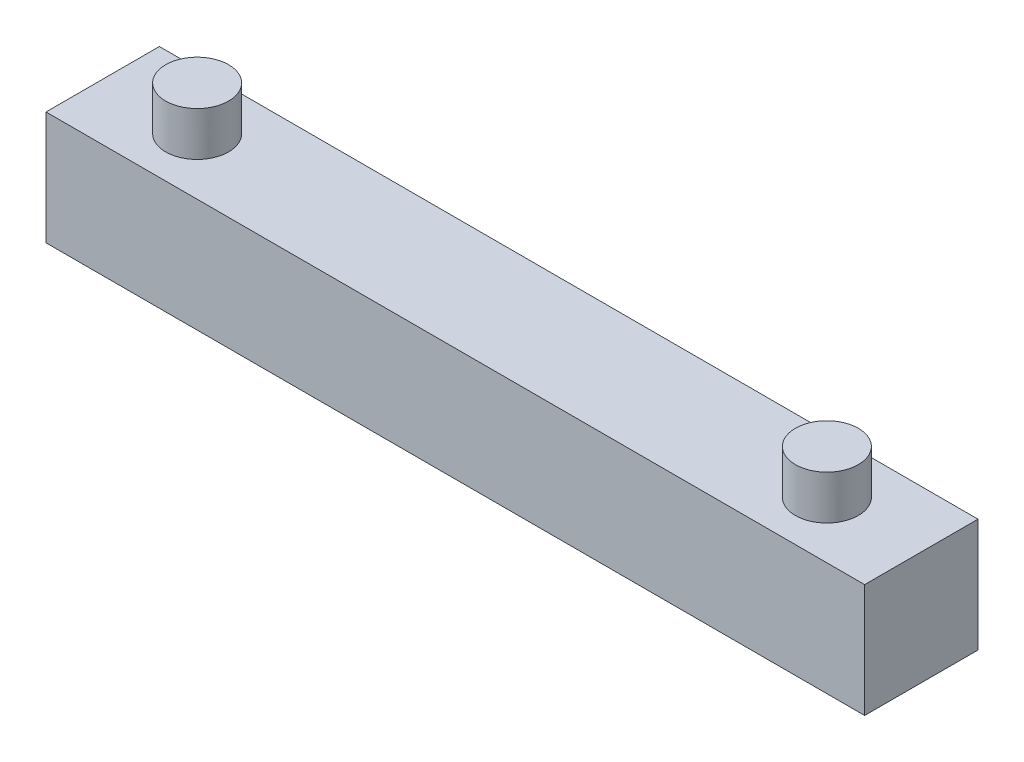
ISO-10303-21;
HEADER;
FILE_DESCRIPTION(('STEP AP214'),'2;1');
FILE_NAME('part.step','',(''),(''),'','','');
FILE_SCHEMA(('AUTOMOTIVE_DESIGN { 1 0 10303 214 1 1 1 1 }'));
ENDSEC;
DATA;
#1=APPLICATION_CONTEXT('core data for automotive mechanical design processes');
#2=APPLICATION_PROTOCOL_DEFINITION('international standard','automotive_design',2000,#1);
#3=PRODUCT_CONTEXT('',#1,'mechanical');
#4=PRODUCT('Part','Part','',(#3));
#5=PRODUCT_RELATED_PRODUCT_CATEGORY('part','',(#4));
#6=PRODUCT_DEFINITION_FORMATION('','',#4);
#7=PRODUCT_DEFINITION_CONTEXT('part definition',#1,'design');
#8=PRODUCT_DEFINITION('design','',#6,#7);
#9=PRODUCT_DEFINITION_SHAPE('','',#8);
#10=(LENGTH_UNIT() NAMED_UNIT(*) SI_UNIT(.MILLI.,.METRE.));
#11=(NAMED_UNIT(*) PLANE_ANGLE_UNIT() SI_UNIT($,.RADIAN.));
#12=(NAMED_UNIT(*) SI_UNIT($,.STERADIAN.) SOLID_ANGLE_UNIT());
#13=UNCERTAINTY_MEASURE_WITH_UNIT(LENGTH_MEASURE(1.E-05),#10,'distance_accuracy_value','');
#14=(GEOMETRIC_REPRESENTATION_CONTEXT(3) GLOBAL_UNCERTAINTY_ASSIGNED_CONTEXT((#13)) GLOBAL_UNIT_ASSIGNED_CONTEXT((#10,
#11,#12)) REPRESENTATION_CONTEXT('',''));
#15=CARTESIAN_POINT('',(0.,0.,0.));
#16=DIRECTION('',(0.,0.,1.));
#17=DIRECTION('',(1.,0.,0.));
#18=AXIS2_PLACEMENT_3D('',#15,#16,#17);
#19=CARTESIAN_POINT('',(0.,9.,0.));
#20=DIRECTION('',(1.,0.,0.));
#21=DIRECTION('',(0.,0.,-1.));
#22=AXIS2_PLACEMENT_3D('',#19,#20,#21);
#23=PLANE('',#22);
#24=DIRECTION('',(0.,0.,1.));
#25=VECTOR('',#24,1.);
#26=CARTESIAN_POINT('',(0.,0.,0.));
#27=LINE('',#26,#25);
#28=CARTESIAN_POINT('',(0.,0.,-9.));
#29=VERTEX_POINT('',#28);
#30=CARTESIAN_POINT('',(0.,0.,0.));
#31=VERTEX_POINT('',#30);
#32=EDGE_CURVE('E100',#29,#31,#27,.T.);
#33=ORIENTED_EDGE('',*,*,#32,.T.);
#34=DIRECTION('',(0.,-1.,0.));
#35=VECTOR('',#34,1.);
#36=CARTESIAN_POINT('',(0.,9.,0.));
#37=LINE('',#36,#35);
#38=CARTESIAN_POINT('',(0.,9.,0.));
#39=VERTEX_POINT('',#38);
#40=EDGE_CURVE('E91',#39,#31,#37,.T.);
#41=ORIENTED_EDGE('',*,*,#40,.F.);
#42=DIRECTION('',(0.,0.,1.));
#43=VECTOR('',#42,1.);
#44=CARTESIAN_POINT('',(0.,9.,0.));
#45=LINE('',#44,#43);
#46=CARTESIAN_POINT('',(0.,9.,-9.));
#47=VERTEX_POINT('',#46);
#48=EDGE_CURVE('E85',#47,#39,#45,.T.);
#49=ORIENTED_EDGE('',*,*,#48,.F.);
#50=DIRECTION('',(0.,-1.,0.));
#51=VECTOR('',#50,1.);
#52=CARTESIAN_POINT('',(0.,9.,-9.));
#53=LINE('',#52,#51);
#54=EDGE_CURVE('E96',#47,#29,#53,.T.);
#55=ORIENTED_EDGE('',*,*,#54,.T.);
#56=EDGE_LOOP('',(#33,#41,#49,#55));
#57=FACE_BOUND('',#56,.T.);
#58=ADVANCED_FACE('F33',(#57),#23,.F.);
#59=CARTESIAN_POINT('',(0.,9.,0.));
#60=DIRECTION('',(0.,0.,-1.));
#61=DIRECTION('',(-1.,0.,0.));
#62=AXIS2_PLACEMENT_3D('',#59,#60,#61);
#63=PLANE('',#62);
#64=DIRECTION('',(1.,0.,0.));
#65=VECTOR('',#64,1.);
#66=CARTESIAN_POINT('',(0.,0.,0.));
#67=LINE('',#66,#65);
#68=CARTESIAN_POINT('',(65.,0.,0.));
#69=VERTEX_POINT('',#68);
#70=EDGE_CURVE('E90',#31,#69,#67,.T.);
#71=ORIENTED_EDGE('',*,*,#70,.T.);
#72=DIRECTION('',(0.,-1.,0.));
#73=VECTOR('',#72,1.);
#74=CARTESIAN_POINT('',(65.,9.,0.));
#75=LINE('',#74,#73);
#76=CARTESIAN_POINT('',(65.,9.,0.));
#77=VERTEX_POINT('',#76);
#78=EDGE_CURVE('E88',#77,#69,#75,.T.);
#79=ORIENTED_EDGE('',*,*,#78,.F.);
#80=DIRECTION('',(1.,0.,0.));
#81=VECTOR('',#80,1.);
#82=CARTESIAN_POINT('',(0.,9.,0.));
#83=LINE('',#82,#81);
#84=EDGE_CURVE('E80',#39,#77,#83,.T.);
#85=ORIENTED_EDGE('',*,*,#84,.F.);
#86=ORIENTED_EDGE('',*,*,#40,.T.);
#87=EDGE_LOOP('',(#71,#79,#85,#86));
#88=FACE_BOUND('',#87,.T.);
#89=ADVANCED_FACE('F89',(#88),#63,.F.);
#90=CARTESIAN_POINT('',(65.,9.,0.));
#91=DIRECTION('',(-1.,0.,0.));
#92=DIRECTION('',(0.,0.,1.));
#93=AXIS2_PLACEMENT_3D('',#90,#91,#92);
#94=PLANE('',#93);
#95=DIRECTION('',(0.,0.,-1.));
#96=VECTOR('',#95,1.);
#97=CARTESIAN_POINT('',(65.,0.,0.));
#98=LINE('',#97,#96);
#99=CARTESIAN_POINT('',(65.,0.,-9.));
#100=VERTEX_POINT('',#99);
#101=EDGE_CURVE('E66',#69,#100,#98,.T.);
#102=ORIENTED_EDGE('',*,*,#101,.T.);
#103=DIRECTION('',(0.,-1.,0.));
#104=VECTOR('',#103,1.);
#105=CARTESIAN_POINT('',(65.,9.,-9.));
#106=LINE('',#105,#104);
#107=CARTESIAN_POINT('',(65.,9.,-9.));
#108=VERTEX_POINT('',#107);
#109=EDGE_CURVE('E92',#108,#100,#106,.T.);
#110=ORIENTED_EDGE('',*,*,#109,.F.);
#111=DIRECTION('',(0.,0.,-1.));
#112=VECTOR('',#111,1.);
#113=CARTESIAN_POINT('',(65.,9.,0.));
#114=LINE('',#113,#112);
#115=EDGE_CURVE('E83',#77,#108,#114,.T.);
#116=ORIENTED_EDGE('',*,*,#115,.F.);
#117=ORIENTED_EDGE('',*,*,#78,.T.);
#118=EDGE_LOOP('',(#102,#110,#116,#117));
#119=FACE_BOUND('',#118,.T.);
#120=ADVANCED_FACE('F94',(#119),#94,.F.);
#121=CARTESIAN_POINT('',(0.,9.,-9.));
#122=DIRECTION('',(0.,0.,1.));
#123=DIRECTION('',(1.,0.,0.));
#124=AXIS2_PLACEMENT_3D('',#121,#122,#123);
#125=PLANE('',#124);
#126=DIRECTION('',(-1.,0.,0.));
#127=VECTOR('',#126,1.);
#128=CARTESIAN_POINT('',(0.,0.,-9.));
#129=LINE('',#128,#127);
#130=EDGE_CURVE('E72',#100,#29,#129,.T.);
#131=ORIENTED_EDGE('',*,*,#130,.T.);
#132=ORIENTED_EDGE('',*,*,#54,.F.);
#133=DIRECTION('',(-1.,0.,0.));
#134=VECTOR('',#133,1.);
#135=CARTESIAN_POINT('',(0.,9.,-9.));
#136=LINE('',#135,#134);
#137=EDGE_CURVE('E49',#108,#47,#136,.T.);
#138=ORIENTED_EDGE('',*,*,#137,.F.);
#139=ORIENTED_EDGE('',*,*,#109,.T.);
#140=EDGE_LOOP('',(#131,#132,#138,#139));
#141=FACE_BOUND('',#140,.T.);
#142=ADVANCED_FACE('F116',(#141),#125,.F.);
#143=CARTESIAN_POINT('',(0.,9.,0.));
#144=DIRECTION('',(0.,-1.,0.));
#145=DIRECTION('',(0.,0.,-1.));
#146=AXIS2_PLACEMENT_3D('',#143,#144,#145);
#147=PLANE('',#146);
#148=CARTESIAN_POINT('',(57.5,9.,-4.5));
#149=DIRECTION('',(0.,-1.,0.));
#150=DIRECTION('',(0.,0.,-1.));
#151=AXIS2_PLACEMENT_3D('',#148,#149,#150);
#152=CIRCLE('',#151,2.5);
#153=CARTESIAN_POINT('',(57.5,9.,-7.));
#154=VERTEX_POINT('',#153);
#155=EDGE_CURVE('E11',#154,#154,#152,.F.);
#156=ORIENTED_EDGE('',*,*,#155,.F.);
#157=EDGE_LOOP('',(#156));
#158=FACE_BOUND('',#157,.T.);
#159=CARTESIAN_POINT('',(7.5,9.,-4.5));
#160=DIRECTION('',(0.,-1.,0.));
#161=DIRECTION('',(0.,0.,-1.));
#162=AXIS2_PLACEMENT_3D('',#159,#160,#161);
#163=CIRCLE('',#162,2.5);
#164=CARTESIAN_POINT('',(7.5,9.,-7.));
#165=VERTEX_POINT('',#164);
#166=EDGE_CURVE('E41',#165,#165,#163,.F.);
#167=ORIENTED_EDGE('',*,*,#166,.F.);
#168=EDGE_LOOP('',(#167));
#169=FACE_BOUND('',#168,.T.);
#170=ORIENTED_EDGE('',*,*,#48,.T.);
#171=ORIENTED_EDGE('',*,*,#84,.T.);
#172=ORIENTED_EDGE('',*,*,#115,.T.);
#173=ORIENTED_EDGE('',*,*,#137,.T.);
#174=EDGE_LOOP('',(#170,#171,#172,#173));
#175=FACE_BOUND('',#174,.T.);
#176=ADVANCED_FACE('F81',(#158,#169,#175),#147,.F.);
#177=CARTESIAN_POINT('',(0.,0.,0.));
#178=DIRECTION('',(0.,-1.,0.));
#179=DIRECTION('',(0.,0.,-1.));
#180=AXIS2_PLACEMENT_3D('',#177,#178,#179);
#181=PLANE('',#180);
#182=ORIENTED_EDGE('',*,*,#32,.F.);
#183=ORIENTED_EDGE('',*,*,#130,.F.);
#184=ORIENTED_EDGE('',*,*,#101,.F.);
#185=ORIENTED_EDGE('',*,*,#70,.F.);
#186=EDGE_LOOP('',(#182,#183,#184,#185));
#187=FACE_BOUND('',#186,.T.);
#188=ADVANCED_FACE('F115',(#187),#181,.T.);
#189=CARTESIAN_POINT('',(7.5,12.5,-4.5));
#190=DIRECTION('',(0.,-1.,0.));
#191=DIRECTION('',(0.,0.,-1.));
#192=AXIS2_PLACEMENT_3D('',#189,#190,#191);
#193=CYLINDRICAL_SURFACE('',#192,2.5);
#194=CARTESIAN_POINT('',(7.5,12.5,-4.5));
#195=DIRECTION('',(0.,1.,0.));
#196=DIRECTION('',(0.,0.,1.));
#197=AXIS2_PLACEMENT_3D('',#194,#195,#196);
#198=CIRCLE('',#197,2.5);
#199=CARTESIAN_POINT('',(7.5,12.5,-2.));
#200=VERTEX_POINT('',#199);
#201=EDGE_CURVE('E103',#200,#200,#198,.T.);
#202=ORIENTED_EDGE('',*,*,#201,.F.);
#203=EDGE_LOOP('',(#202));
#204=FACE_BOUND('',#203,.T.);
#205=ORIENTED_EDGE('',*,*,#166,.T.);
#206=EDGE_LOOP('',(#205));
#207=FACE_BOUND('',#206,.T.);
#208=ADVANCED_FACE('F112',(#204,#207),#193,.T.);
#209=CARTESIAN_POINT('',(7.5,12.5,-4.5));
#210=DIRECTION('',(0.,1.,0.));
#211=DIRECTION('',(0.,0.,1.));
#212=AXIS2_PLACEMENT_3D('',#209,#210,#211);
#213=PLANE('',#212);
#214=ORIENTED_EDGE('',*,*,#201,.T.);
#215=EDGE_LOOP('',(#214));
#216=FACE_BOUND('',#215,.T.);
#217=ADVANCED_FACE('F146',(#216),#213,.T.);
#218=CARTESIAN_POINT('',(57.5,12.5,-4.5));
#219=DIRECTION('',(0.,-1.,0.));
#220=DIRECTION('',(0.,0.,-1.));
#221=AXIS2_PLACEMENT_3D('',#218,#219,#220);
#222=CYLINDRICAL_SURFACE('',#221,2.5);
#223=CARTESIAN_POINT('',(57.5,12.5,-4.5));
#224=DIRECTION('',(0.,1.,0.));
#225=DIRECTION('',(0.,0.,1.));
#226=AXIS2_PLACEMENT_3D('',#223,#224,#225);
#227=CIRCLE('',#226,2.5);
#228=CARTESIAN_POINT('',(57.5,12.5,-2.));
#229=VERTEX_POINT('',#228);
#230=EDGE_CURVE('E137',#229,#229,#227,.T.);
#231=ORIENTED_EDGE('',*,*,#230,.F.);
#232=EDGE_LOOP('',(#231));
#233=FACE_BOUND('',#232,.T.);
#234=ORIENTED_EDGE('',*,*,#155,.T.);
#235=EDGE_LOOP('',(#234));
#236=FACE_BOUND('',#235,.T.);
#237=ADVANCED_FACE('F143',(#233,#236),#222,.T.);
#238=CARTESIAN_POINT('',(57.5,12.5,-4.5));
#239=DIRECTION('',(0.,1.,0.));
#240=DIRECTION('',(0.,0.,1.));
#241=AXIS2_PLACEMENT_3D('',#238,#239,#240);
#242=PLANE('',#241);
#243=ORIENTED_EDGE('',*,*,#230,.T.);
#244=EDGE_LOOP('',(#243));
#245=FACE_BOUND('',#244,.T.);
#246=ADVANCED_FACE('F141',(#245),#242,.T.);
#247=CLOSED_SHELL('',(#58,#89,#120,#142,#176,#188,#208,#217,#237,#246));
#248=MANIFOLD_SOLID_BREP('B2',#247);
#249=ADVANCED_BREP_SHAPE_REPRESENTATION('',(#18,#248),#14);
#250=SHAPE_DEFINITION_REPRESENTATION(#9,#249);
ENDSEC;
END-ISO-10303-21;
